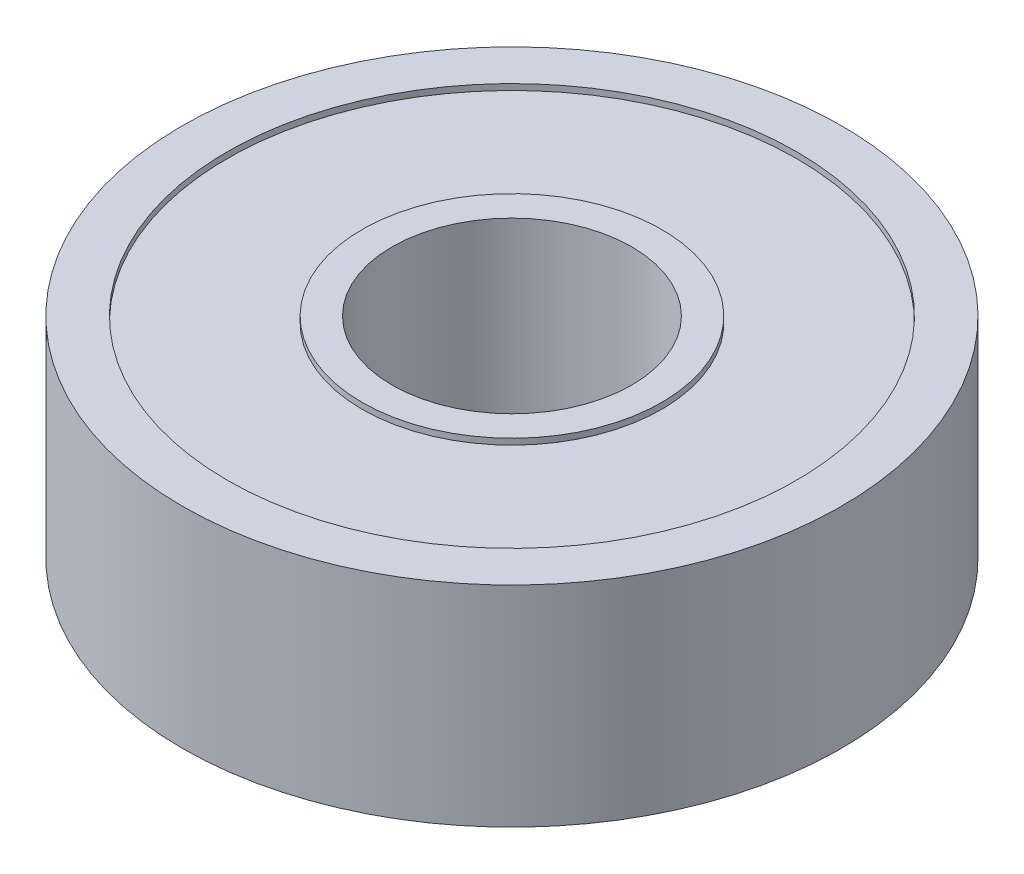
ISO-10303-21;
HEADER;
FILE_DESCRIPTION(('STEP AP214'),'2;1');
FILE_NAME('part.step','',(''),(''),'','','');
FILE_SCHEMA(('AUTOMOTIVE_DESIGN { 1 0 10303 214 1 1 1 1 }'));
ENDSEC;
DATA;
#1=APPLICATION_CONTEXT('core data for automotive mechanical design processes');
#2=APPLICATION_PROTOCOL_DEFINITION('international standard','automotive_design',2000,#1);
#3=PRODUCT_CONTEXT('',#1,'mechanical');
#4=PRODUCT('Part','Part','',(#3));
#5=PRODUCT_RELATED_PRODUCT_CATEGORY('part','',(#4));
#6=PRODUCT_DEFINITION_FORMATION('','',#4);
#7=PRODUCT_DEFINITION_CONTEXT('part definition',#1,'design');
#8=PRODUCT_DEFINITION('design','',#6,#7);
#9=PRODUCT_DEFINITION_SHAPE('','',#8);
#10=(LENGTH_UNIT() NAMED_UNIT(*) SI_UNIT(.MILLI.,.METRE.));
#11=(NAMED_UNIT(*) PLANE_ANGLE_UNIT() SI_UNIT($,.RADIAN.));
#12=(NAMED_UNIT(*) SI_UNIT($,.STERADIAN.) SOLID_ANGLE_UNIT());
#13=UNCERTAINTY_MEASURE_WITH_UNIT(LENGTH_MEASURE(1.E-05),#10,'distance_accuracy_value','');
#14=(GEOMETRIC_REPRESENTATION_CONTEXT(3) GLOBAL_UNCERTAINTY_ASSIGNED_CONTEXT((#13)) GLOBAL_UNIT_ASSIGNED_CONTEXT((#10,
#11,#12)) REPRESENTATION_CONTEXT('',''));
#15=CARTESIAN_POINT('',(0.,0.,0.));
#16=DIRECTION('',(0.,0.,1.));
#17=DIRECTION('',(1.,0.,0.));
#18=AXIS2_PLACEMENT_3D('',#15,#16,#17);
#19=CARTESIAN_POINT('',(0.,-3.5,0.));
#20=DIRECTION('',(0.,1.,0.));
#21=DIRECTION('',(0.,0.,1.));
#22=AXIS2_PLACEMENT_3D('',#19,#20,#21);
#23=PLANE('',#22);
#24=CARTESIAN_POINT('',(0.,-3.5,0.));
#25=DIRECTION('',(0.,1.,0.));
#26=DIRECTION('',(0.,0.,1.));
#27=AXIS2_PLACEMENT_3D('',#24,#25,#26);
#28=CIRCLE('',#27,4.);
#29=CARTESIAN_POINT('',(0.,-3.5,4.));
#30=VERTEX_POINT('',#29);
#31=EDGE_CURVE('E54',#30,#30,#28,.T.);
#32=ORIENTED_EDGE('',*,*,#31,.T.);
#33=EDGE_LOOP('',(#32));
#34=FACE_BOUND('',#33,.T.);
#35=CARTESIAN_POINT('',(0.,-3.5,0.));
#36=DIRECTION('',(0.,1.,0.));
#37=DIRECTION('',(0.,0.,1.));
#38=AXIS2_PLACEMENT_3D('',#35,#36,#37);
#39=CIRCLE('',#38,5.);
#40=CARTESIAN_POINT('',(0.,-3.5,5.));
#41=VERTEX_POINT('',#40);
#42=EDGE_CURVE('E78',#41,#41,#39,.T.);
#43=ORIENTED_EDGE('',*,*,#42,.F.);
#44=EDGE_LOOP('',(#43));
#45=FACE_BOUND('',#44,.T.);
#46=ADVANCED_FACE('F41',(#34,#45),#23,.F.);
#47=CARTESIAN_POINT('',(0.,3.5,0.));
#48=DIRECTION('',(0.,1.,0.));
#49=DIRECTION('',(0.,0.,1.));
#50=AXIS2_PLACEMENT_3D('',#47,#48,#49);
#51=PLANE('',#50);
#52=CARTESIAN_POINT('',(0.,3.5,0.));
#53=DIRECTION('',(0.,1.,0.));
#54=DIRECTION('',(0.,0.,1.));
#55=AXIS2_PLACEMENT_3D('',#52,#53,#54);
#56=CIRCLE('',#55,4.);
#57=CARTESIAN_POINT('',(0.,3.5,4.));
#58=VERTEX_POINT('',#57);
#59=EDGE_CURVE('E52',#58,#58,#56,.T.);
#60=ORIENTED_EDGE('',*,*,#59,.F.);
#61=EDGE_LOOP('',(#60));
#62=FACE_BOUND('',#61,.T.);
#63=CARTESIAN_POINT('',(0.,3.5,0.));
#64=DIRECTION('',(0.,1.,0.));
#65=DIRECTION('',(0.,0.,1.));
#66=AXIS2_PLACEMENT_3D('',#63,#64,#65);
#67=CIRCLE('',#66,5.);
#68=CARTESIAN_POINT('',(0.,3.5,5.));
#69=VERTEX_POINT('',#68);
#70=EDGE_CURVE('E62',#69,#69,#67,.T.);
#71=ORIENTED_EDGE('',*,*,#70,.T.);
#72=EDGE_LOOP('',(#71));
#73=FACE_BOUND('',#72,.T.);
#74=ADVANCED_FACE('F94',(#62,#73),#51,.T.);
#75=CARTESIAN_POINT('',(0.,3.5,0.));
#76=DIRECTION('',(0.,1.,0.));
#77=DIRECTION('',(0.,0.,1.));
#78=AXIS2_PLACEMENT_3D('',#75,#76,#77);
#79=CIRCLE('',#78,9.5);
#80=CARTESIAN_POINT('',(0.,3.5,9.5));
#81=VERTEX_POINT('',#80);
#82=EDGE_CURVE('E57',#81,#81,#79,.T.);
#83=ORIENTED_EDGE('',*,*,#82,.F.);
#84=EDGE_LOOP('',(#83));
#85=FACE_BOUND('',#84,.T.);
#86=CARTESIAN_POINT('',(0.,3.5,0.));
#87=DIRECTION('',(0.,1.,0.));
#88=DIRECTION('',(0.,0.,1.));
#89=AXIS2_PLACEMENT_3D('',#86,#87,#88);
#90=CIRCLE('',#89,11.);
#91=CARTESIAN_POINT('',(0.,3.5,11.));
#92=VERTEX_POINT('',#91);
#93=EDGE_CURVE('E10',#92,#92,#90,.T.);
#94=ORIENTED_EDGE('',*,*,#93,.T.);
#95=EDGE_LOOP('',(#94));
#96=FACE_BOUND('',#95,.T.);
#97=ADVANCED_FACE('F102',(#85,#96),#51,.T.);
#98=CARTESIAN_POINT('',(0.,-3.5,0.));
#99=DIRECTION('',(0.,1.,0.));
#100=DIRECTION('',(0.,0.,1.));
#101=AXIS2_PLACEMENT_3D('',#98,#99,#100);
#102=CIRCLE('',#101,9.5);
#103=CARTESIAN_POINT('',(0.,-3.5,9.5));
#104=VERTEX_POINT('',#103);
#105=EDGE_CURVE('E72',#104,#104,#102,.T.);
#106=ORIENTED_EDGE('',*,*,#105,.T.);
#107=EDGE_LOOP('',(#106));
#108=FACE_BOUND('',#107,.T.);
#109=CARTESIAN_POINT('',(0.,-3.5,0.));
#110=DIRECTION('',(0.,1.,0.));
#111=DIRECTION('',(0.,0.,1.));
#112=AXIS2_PLACEMENT_3D('',#109,#110,#111);
#113=CIRCLE('',#112,11.);
#114=CARTESIAN_POINT('',(0.,-3.5,11.));
#115=VERTEX_POINT('',#114);
#116=EDGE_CURVE('E45',#115,#115,#113,.T.);
#117=ORIENTED_EDGE('',*,*,#116,.F.);
#118=EDGE_LOOP('',(#117));
#119=FACE_BOUND('',#118,.T.);
#120=ADVANCED_FACE('F96',(#108,#119),#23,.F.);
#121=CARTESIAN_POINT('',(0.,3.5,0.));
#122=DIRECTION('',(0.,-1.,0.));
#123=DIRECTION('',(0.,0.,-1.));
#124=AXIS2_PLACEMENT_3D('',#121,#122,#123);
#125=CYLINDRICAL_SURFACE('',#124,11.);
#126=ORIENTED_EDGE('',*,*,#93,.F.);
#127=EDGE_LOOP('',(#126));
#128=FACE_BOUND('',#127,.T.);
#129=ORIENTED_EDGE('',*,*,#116,.T.);
#130=EDGE_LOOP('',(#129));
#131=FACE_BOUND('',#130,.T.);
#132=ADVANCED_FACE('F43',(#128,#131),#125,.T.);
#133=CARTESIAN_POINT('',(0.,3.5,0.));
#134=DIRECTION('',(0.,-1.,0.));
#135=DIRECTION('',(0.,0.,-1.));
#136=AXIS2_PLACEMENT_3D('',#133,#134,#135);
#137=CYLINDRICAL_SURFACE('',#136,4.);
#138=ORIENTED_EDGE('',*,*,#59,.T.);
#139=EDGE_LOOP('',(#138));
#140=FACE_BOUND('',#139,.T.);
#141=ORIENTED_EDGE('',*,*,#31,.F.);
#142=EDGE_LOOP('',(#141));
#143=FACE_BOUND('',#142,.T.);
#144=ADVANCED_FACE('F110',(#140,#143),#137,.F.);
#145=CARTESIAN_POINT('',(0.,3.4,0.));
#146=DIRECTION('',(0.,1.,0.));
#147=DIRECTION('',(0.,0.,1.));
#148=AXIS2_PLACEMENT_3D('',#145,#146,#147);
#149=CYLINDRICAL_SURFACE('',#148,9.5);
#150=ORIENTED_EDGE('',*,*,#82,.T.);
#151=EDGE_LOOP('',(#150));
#152=FACE_BOUND('',#151,.T.);
#153=CARTESIAN_POINT('',(0.,3.3,0.));
#154=DIRECTION('',(0.,1.,0.));
#155=DIRECTION('',(0.,0.,1.));
#156=AXIS2_PLACEMENT_3D('',#153,#154,#155);
#157=CIRCLE('',#156,9.5);
#158=CARTESIAN_POINT('',(0.,3.3,9.5));
#159=VERTEX_POINT('',#158);
#160=EDGE_CURVE('E65',#159,#159,#157,.T.);
#161=ORIENTED_EDGE('',*,*,#160,.F.);
#162=EDGE_LOOP('',(#161));
#163=FACE_BOUND('',#162,.T.);
#164=ADVANCED_FACE('F134',(#152,#163),#149,.F.);
#165=CARTESIAN_POINT('',(0.,3.4,0.));
#166=DIRECTION('',(0.,1.,0.));
#167=DIRECTION('',(0.,0.,1.));
#168=AXIS2_PLACEMENT_3D('',#165,#166,#167);
#169=CYLINDRICAL_SURFACE('',#168,5.);
#170=ORIENTED_EDGE('',*,*,#70,.F.);
#171=EDGE_LOOP('',(#170));
#172=FACE_BOUND('',#171,.T.);
#173=CARTESIAN_POINT('',(0.,3.3,0.));
#174=DIRECTION('',(0.,1.,0.));
#175=DIRECTION('',(0.,0.,1.));
#176=AXIS2_PLACEMENT_3D('',#173,#174,#175);
#177=CIRCLE('',#176,5.);
#178=CARTESIAN_POINT('',(0.,3.3,5.));
#179=VERTEX_POINT('',#178);
#180=EDGE_CURVE('E68',#179,#179,#177,.T.);
#181=ORIENTED_EDGE('',*,*,#180,.T.);
#182=EDGE_LOOP('',(#181));
#183=FACE_BOUND('',#182,.T.);
#184=ADVANCED_FACE('F130',(#172,#183),#169,.T.);
#185=CARTESIAN_POINT('',(0.,3.3,0.));
#186=DIRECTION('',(0.,-1.,0.));
#187=DIRECTION('',(0.,0.,1.));
#188=AXIS2_PLACEMENT_3D('',#185,#186,#187);
#189=PLANE('',#188);
#190=ORIENTED_EDGE('',*,*,#160,.T.);
#191=EDGE_LOOP('',(#190));
#192=FACE_BOUND('',#191,.T.);
#193=ORIENTED_EDGE('',*,*,#180,.F.);
#194=EDGE_LOOP('',(#193));
#195=FACE_BOUND('',#194,.T.);
#196=ADVANCED_FACE('F124',(#192,#195),#189,.F.);
#197=CARTESIAN_POINT('',(0.,-3.4,0.));
#198=DIRECTION('',(0.,-1.,0.));
#199=DIRECTION('',(0.,0.,1.));
#200=AXIS2_PLACEMENT_3D('',#197,#198,#199);
#201=PLANE('',#200);
#202=CARTESIAN_POINT('',(0.,-3.4,0.));
#203=DIRECTION('',(0.,1.,0.));
#204=DIRECTION('',(0.,0.,1.));
#205=AXIS2_PLACEMENT_3D('',#202,#203,#204);
#206=CIRCLE('',#205,9.5);
#207=CARTESIAN_POINT('',(0.,-3.4,9.5));
#208=VERTEX_POINT('',#207);
#209=EDGE_CURVE('E71',#208,#208,#206,.T.);
#210=ORIENTED_EDGE('',*,*,#209,.F.);
#211=EDGE_LOOP('',(#210));
#212=FACE_BOUND('',#211,.T.);
#213=CARTESIAN_POINT('',(0.,-3.4,0.));
#214=DIRECTION('',(0.,1.,0.));
#215=DIRECTION('',(0.,0.,1.));
#216=AXIS2_PLACEMENT_3D('',#213,#214,#215);
#217=CIRCLE('',#216,5.);
#218=CARTESIAN_POINT('',(0.,-3.4,5.));
#219=VERTEX_POINT('',#218);
#220=EDGE_CURVE('E75',#219,#219,#217,.T.);
#221=ORIENTED_EDGE('',*,*,#220,.T.);
#222=EDGE_LOOP('',(#221));
#223=FACE_BOUND('',#222,.T.);
#224=ADVANCED_FACE('F84',(#212,#223),#201,.T.);
#225=CARTESIAN_POINT('',(0.,-3.4,0.));
#226=DIRECTION('',(0.,-1.,0.));
#227=DIRECTION('',(0.,0.,-1.));
#228=AXIS2_PLACEMENT_3D('',#225,#226,#227);
#229=CYLINDRICAL_SURFACE('',#228,9.5);
#230=ORIENTED_EDGE('',*,*,#209,.T.);
#231=EDGE_LOOP('',(#230));
#232=FACE_BOUND('',#231,.T.);
#233=ORIENTED_EDGE('',*,*,#105,.F.);
#234=EDGE_LOOP('',(#233));
#235=FACE_BOUND('',#234,.T.);
#236=ADVANCED_FACE('F89',(#232,#235),#229,.F.);
#237=CARTESIAN_POINT('',(0.,-3.4,0.));
#238=DIRECTION('',(0.,-1.,0.));
#239=DIRECTION('',(0.,0.,-1.));
#240=AXIS2_PLACEMENT_3D('',#237,#238,#239);
#241=CYLINDRICAL_SURFACE('',#240,5.);
#242=ORIENTED_EDGE('',*,*,#220,.F.);
#243=EDGE_LOOP('',(#242));
#244=FACE_BOUND('',#243,.T.);
#245=ORIENTED_EDGE('',*,*,#42,.T.);
#246=EDGE_LOOP('',(#245));
#247=FACE_BOUND('',#246,.T.);
#248=ADVANCED_FACE('F86',(#244,#247),#241,.T.);
#249=CLOSED_SHELL('',(#46,#74,#97,#120,#132,#144,#164,#184,#196,#224,#236,#248));
#250=MANIFOLD_SOLID_BREP('B2',#249);
#251=ADVANCED_BREP_SHAPE_REPRESENTATION('',(#18,#250),#14);
#252=SHAPE_DEFINITION_REPRESENTATION(#9,#251);
ENDSEC;
END-ISO-10303-21;
